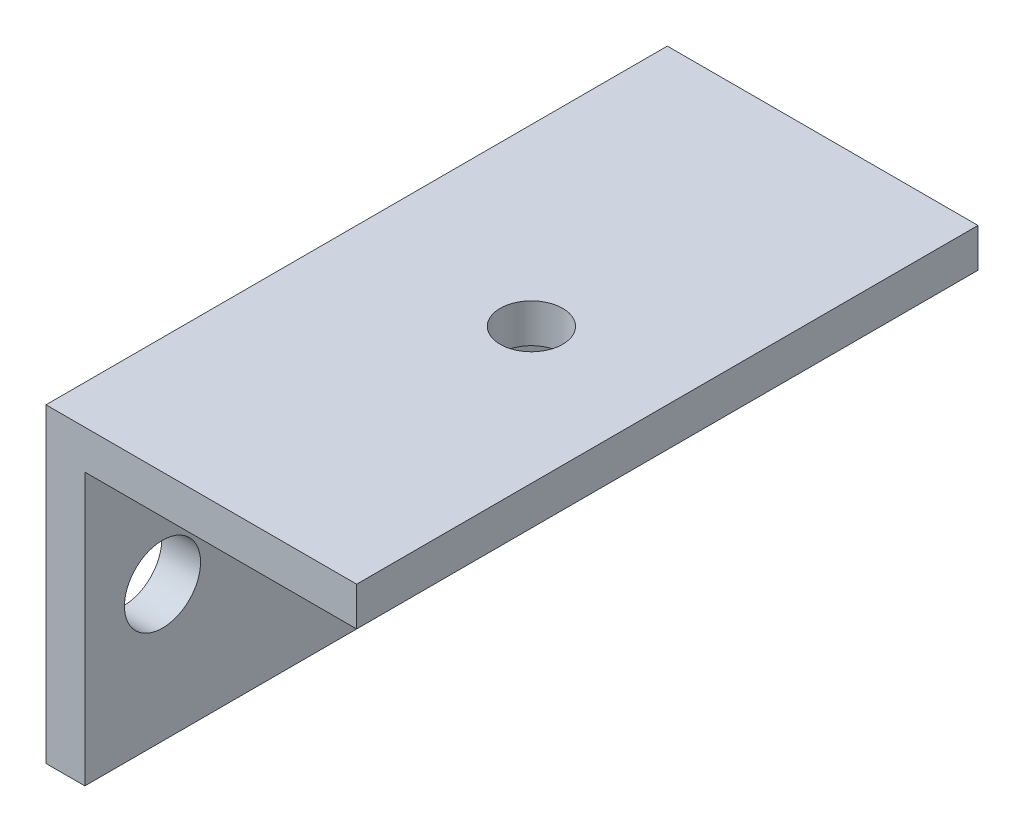
ISO-10303-21;
HEADER;
FILE_DESCRIPTION(('STEP AP214'),'2;1');
FILE_NAME('part.step','',(''),(''),'','','');
FILE_SCHEMA(('AUTOMOTIVE_DESIGN { 1 0 10303 214 1 1 1 1 }'));
ENDSEC;
DATA;
#1=APPLICATION_CONTEXT('core data for automotive mechanical design processes');
#2=APPLICATION_PROTOCOL_DEFINITION('international standard','automotive_design',2000,#1);
#3=PRODUCT_CONTEXT('',#1,'mechanical');
#4=PRODUCT('Part','Part','',(#3));
#5=PRODUCT_RELATED_PRODUCT_CATEGORY('part','',(#4));
#6=PRODUCT_DEFINITION_FORMATION('','',#4);
#7=PRODUCT_DEFINITION_CONTEXT('part definition',#1,'design');
#8=PRODUCT_DEFINITION('design','',#6,#7);
#9=PRODUCT_DEFINITION_SHAPE('','',#8);
#10=(LENGTH_UNIT() NAMED_UNIT(*) SI_UNIT(.MILLI.,.METRE.));
#11=(NAMED_UNIT(*) PLANE_ANGLE_UNIT() SI_UNIT($,.RADIAN.));
#12=(NAMED_UNIT(*) SI_UNIT($,.STERADIAN.) SOLID_ANGLE_UNIT());
#13=UNCERTAINTY_MEASURE_WITH_UNIT(LENGTH_MEASURE(1.E-05),#10,'distance_accuracy_value','');
#14=(GEOMETRIC_REPRESENTATION_CONTEXT(3) GLOBAL_UNCERTAINTY_ASSIGNED_CONTEXT((#13)) GLOBAL_UNIT_ASSIGNED_CONTEXT((#10,
#11,#12)) REPRESENTATION_CONTEXT('',''));
#15=CARTESIAN_POINT('',(0.,0.,0.));
#16=DIRECTION('',(0.,0.,1.));
#17=DIRECTION('',(1.,0.,0.));
#18=AXIS2_PLACEMENT_3D('',#15,#16,#17);
#19=CARTESIAN_POINT('',(3.175,0.,50.8));
#20=DIRECTION('',(0.,1.,0.));
#21=DIRECTION('',(-1.,0.,0.));
#22=AXIS2_PLACEMENT_3D('',#19,#20,#21);
#23=PLANE('',#22);
#24=DIRECTION('',(1.,0.,0.));
#25=VECTOR('',#24,1.);
#26=CARTESIAN_POINT('',(3.175,0.,0.));
#27=LINE('',#26,#25);
#28=CARTESIAN_POINT('',(0.,0.,0.));
#29=VERTEX_POINT('',#28);
#30=CARTESIAN_POINT('',(3.175,0.,0.));
#31=VERTEX_POINT('',#30);
#32=EDGE_CURVE('E130',#29,#31,#27,.T.);
#33=ORIENTED_EDGE('',*,*,#32,.T.);
#34=DIRECTION('',(0.,0.,-1.));
#35=VECTOR('',#34,1.);
#36=CARTESIAN_POINT('',(3.175,0.,50.8));
#37=LINE('',#36,#35);
#38=CARTESIAN_POINT('',(3.175,0.,50.8));
#39=VERTEX_POINT('',#38);
#40=EDGE_CURVE('E13',#39,#31,#37,.T.);
#41=ORIENTED_EDGE('',*,*,#40,.F.);
#42=DIRECTION('',(1.,0.,0.));
#43=VECTOR('',#42,1.);
#44=CARTESIAN_POINT('',(3.175,0.,50.8));
#45=LINE('',#44,#43);
#46=CARTESIAN_POINT('',(0.,0.,50.8));
#47=VERTEX_POINT('',#46);
#48=EDGE_CURVE('E141',#47,#39,#45,.T.);
#49=ORIENTED_EDGE('',*,*,#48,.F.);
#50=DIRECTION('',(0.,0.,-1.));
#51=VECTOR('',#50,1.);
#52=CARTESIAN_POINT('',(0.,0.,50.8));
#53=LINE('',#52,#51);
#54=EDGE_CURVE('E126',#47,#29,#53,.T.);
#55=ORIENTED_EDGE('',*,*,#54,.T.);
#56=EDGE_LOOP('',(#33,#41,#49,#55));
#57=FACE_BOUND('',#56,.T.);
#58=ADVANCED_FACE('F46',(#57),#23,.F.);
#59=CARTESIAN_POINT('',(3.175,22.225,50.8));
#60=DIRECTION('',(-1.,0.,0.));
#61=DIRECTION('',(0.,-1.,0.));
#62=AXIS2_PLACEMENT_3D('',#59,#60,#61);
#63=PLANE('',#62);
#64=CARTESIAN_POINT('',(3.175,11.1125,6.35));
#65=DIRECTION('',(1.,0.,0.));
#66=DIRECTION('',(0.,1.,0.));
#67=AXIS2_PLACEMENT_3D('',#64,#65,#66);
#68=CIRCLE('',#67,3.1115);
#69=CARTESIAN_POINT('',(3.175,14.224,6.35));
#70=VERTEX_POINT('',#69);
#71=EDGE_CURVE('E265',#70,#70,#68,.T.);
#72=ORIENTED_EDGE('',*,*,#71,.F.);
#73=EDGE_LOOP('',(#72));
#74=FACE_BOUND('',#73,.T.);
#75=CARTESIAN_POINT('',(3.175,11.1125,44.45));
#76=DIRECTION('',(1.,0.,0.));
#77=DIRECTION('',(0.,1.,0.));
#78=AXIS2_PLACEMENT_3D('',#75,#76,#77);
#79=CIRCLE('',#78,3.1115);
#80=CARTESIAN_POINT('',(3.175,14.224,44.45));
#81=VERTEX_POINT('',#80);
#82=EDGE_CURVE('E261',#81,#81,#79,.T.);
#83=ORIENTED_EDGE('',*,*,#82,.F.);
#84=EDGE_LOOP('',(#83));
#85=FACE_BOUND('',#84,.T.);
#86=DIRECTION('',(0.,1.,0.));
#87=VECTOR('',#86,1.);
#88=CARTESIAN_POINT('',(3.175,22.225,0.));
#89=LINE('',#88,#87);
#90=CARTESIAN_POINT('',(3.175,22.225,0.));
#91=VERTEX_POINT('',#90);
#92=EDGE_CURVE('E133',#31,#91,#89,.T.);
#93=ORIENTED_EDGE('',*,*,#92,.T.);
#94=DIRECTION('',(0.,0.,-1.));
#95=VECTOR('',#94,1.);
#96=CARTESIAN_POINT('',(3.175,22.225,50.8));
#97=LINE('',#96,#95);
#98=CARTESIAN_POINT('',(3.175,22.225,50.8));
#99=VERTEX_POINT('',#98);
#100=EDGE_CURVE('E54',#99,#91,#97,.T.);
#101=ORIENTED_EDGE('',*,*,#100,.F.);
#102=DIRECTION('',(0.,1.,0.));
#103=VECTOR('',#102,1.);
#104=CARTESIAN_POINT('',(3.175,22.225,50.8));
#105=LINE('',#104,#103);
#106=EDGE_CURVE('E99',#39,#99,#105,.T.);
#107=ORIENTED_EDGE('',*,*,#106,.F.);
#108=ORIENTED_EDGE('',*,*,#40,.T.);
#109=EDGE_LOOP('',(#93,#101,#107,#108));
#110=FACE_BOUND('',#109,.T.);
#111=ADVANCED_FACE('F169',(#74,#85,#110),#63,.F.);
#112=CARTESIAN_POINT('',(25.4,22.225,50.8));
#113=DIRECTION('',(0.,1.,0.));
#114=DIRECTION('',(-1.,0.,0.));
#115=AXIS2_PLACEMENT_3D('',#112,#113,#114);
#116=PLANE('',#115);
#117=CARTESIAN_POINT('',(14.2875,22.225,25.4));
#118=DIRECTION('',(0.,-1.,0.));
#119=DIRECTION('',(0.,0.,-1.));
#120=AXIS2_PLACEMENT_3D('',#117,#118,#119);
#121=CIRCLE('',#120,2.55269999999999);
#122=CARTESIAN_POINT('',(14.2875,22.225,22.8473));
#123=VERTEX_POINT('',#122);
#124=EDGE_CURVE('E275',#123,#123,#121,.T.);
#125=ORIENTED_EDGE('',*,*,#124,.F.);
#126=EDGE_LOOP('',(#125));
#127=FACE_BOUND('',#126,.T.);
#128=DIRECTION('',(1.,0.,0.));
#129=VECTOR('',#128,1.);
#130=CARTESIAN_POINT('',(25.4,22.225,0.));
#131=LINE('',#130,#129);
#132=CARTESIAN_POINT('',(25.4,22.225,0.));
#133=VERTEX_POINT('',#132);
#134=EDGE_CURVE('E136',#91,#133,#131,.T.);
#135=ORIENTED_EDGE('',*,*,#134,.T.);
#136=DIRECTION('',(0.,0.,-1.));
#137=VECTOR('',#136,1.);
#138=CARTESIAN_POINT('',(25.4,22.225,50.8));
#139=LINE('',#138,#137);
#140=CARTESIAN_POINT('',(25.4,22.225,50.8));
#141=VERTEX_POINT('',#140);
#142=EDGE_CURVE('E121',#141,#133,#139,.T.);
#143=ORIENTED_EDGE('',*,*,#142,.F.);
#144=DIRECTION('',(1.,0.,0.));
#145=VECTOR('',#144,1.);
#146=CARTESIAN_POINT('',(25.4,22.225,50.8));
#147=LINE('',#146,#145);
#148=EDGE_CURVE('E112',#99,#141,#147,.T.);
#149=ORIENTED_EDGE('',*,*,#148,.F.);
#150=ORIENTED_EDGE('',*,*,#100,.T.);
#151=EDGE_LOOP('',(#135,#143,#149,#150));
#152=FACE_BOUND('',#151,.T.);
#153=ADVANCED_FACE('F147',(#127,#152),#116,.F.);
#154=CARTESIAN_POINT('',(25.4,25.4,50.8));
#155=DIRECTION('',(-1.,0.,0.));
#156=DIRECTION('',(0.,0.,1.));
#157=AXIS2_PLACEMENT_3D('',#154,#155,#156);
#158=PLANE('',#157);
#159=DIRECTION('',(0.,1.,0.));
#160=VECTOR('',#159,1.);
#161=CARTESIAN_POINT('',(25.4,25.4,0.));
#162=LINE('',#161,#160);
#163=CARTESIAN_POINT('',(25.4,25.4,0.));
#164=VERTEX_POINT('',#163);
#165=EDGE_CURVE('E120',#133,#164,#162,.T.);
#166=ORIENTED_EDGE('',*,*,#165,.T.);
#167=DIRECTION('',(0.,0.,-1.));
#168=VECTOR('',#167,1.);
#169=CARTESIAN_POINT('',(25.4,25.4,50.8));
#170=LINE('',#169,#168);
#171=CARTESIAN_POINT('',(25.4,25.4,50.8));
#172=VERTEX_POINT('',#171);
#173=EDGE_CURVE('E117',#172,#164,#170,.T.);
#174=ORIENTED_EDGE('',*,*,#173,.F.);
#175=DIRECTION('',(0.,1.,0.));
#176=VECTOR('',#175,1.);
#177=CARTESIAN_POINT('',(25.4,25.4,50.8));
#178=LINE('',#177,#176);
#179=EDGE_CURVE('E106',#141,#172,#178,.T.);
#180=ORIENTED_EDGE('',*,*,#179,.F.);
#181=ORIENTED_EDGE('',*,*,#142,.T.);
#182=EDGE_LOOP('',(#166,#174,#180,#181));
#183=FACE_BOUND('',#182,.T.);
#184=ADVANCED_FACE('F118',(#183),#158,.F.);
#185=CARTESIAN_POINT('',(0.,25.4,50.8));
#186=DIRECTION('',(0.,-1.,0.));
#187=DIRECTION('',(0.,0.,-1.));
#188=AXIS2_PLACEMENT_3D('',#185,#186,#187);
#189=PLANE('',#188);
#190=CARTESIAN_POINT('',(14.2875,25.4,25.4));
#191=DIRECTION('',(0.,-1.,0.));
#192=DIRECTION('',(0.,0.,-1.));
#193=AXIS2_PLACEMENT_3D('',#190,#191,#192);
#194=CIRCLE('',#193,2.5527);
#195=CARTESIAN_POINT('',(14.2875,25.4,22.8473));
#196=VERTEX_POINT('',#195);
#197=EDGE_CURVE('E271',#196,#196,#194,.T.);
#198=ORIENTED_EDGE('',*,*,#197,.T.);
#199=EDGE_LOOP('',(#198));
#200=FACE_BOUND('',#199,.T.);
#201=DIRECTION('',(-1.,0.,0.));
#202=VECTOR('',#201,1.);
#203=CARTESIAN_POINT('',(0.,25.4,0.));
#204=LINE('',#203,#202);
#205=CARTESIAN_POINT('',(0.,25.4,0.));
#206=VERTEX_POINT('',#205);
#207=EDGE_CURVE('E85',#164,#206,#204,.T.);
#208=ORIENTED_EDGE('',*,*,#207,.T.);
#209=DIRECTION('',(0.,0.,-1.));
#210=VECTOR('',#209,1.);
#211=CARTESIAN_POINT('',(0.,25.4,50.8));
#212=LINE('',#211,#210);
#213=CARTESIAN_POINT('',(0.,25.4,50.8));
#214=VERTEX_POINT('',#213);
#215=EDGE_CURVE('E122',#214,#206,#212,.T.);
#216=ORIENTED_EDGE('',*,*,#215,.F.);
#217=DIRECTION('',(-1.,0.,0.));
#218=VECTOR('',#217,1.);
#219=CARTESIAN_POINT('',(0.,25.4,50.8));
#220=LINE('',#219,#218);
#221=EDGE_CURVE('E110',#172,#214,#220,.T.);
#222=ORIENTED_EDGE('',*,*,#221,.F.);
#223=ORIENTED_EDGE('',*,*,#173,.T.);
#224=EDGE_LOOP('',(#208,#216,#222,#223));
#225=FACE_BOUND('',#224,.T.);
#226=ADVANCED_FACE('F124',(#200,#225),#189,.F.);
#227=CARTESIAN_POINT('',(0.,0.,50.8));
#228=DIRECTION('',(1.,0.,0.));
#229=DIRECTION('',(0.,0.,-1.));
#230=AXIS2_PLACEMENT_3D('',#227,#228,#229);
#231=PLANE('',#230);
#232=CARTESIAN_POINT('',(0.,11.1125,6.35));
#233=DIRECTION('',(1.,0.,0.));
#234=DIRECTION('',(0.,1.,0.));
#235=AXIS2_PLACEMENT_3D('',#232,#233,#234);
#236=CIRCLE('',#235,3.1115);
#237=CARTESIAN_POINT('',(0.,14.224,6.35));
#238=VERTEX_POINT('',#237);
#239=EDGE_CURVE('E262',#238,#238,#236,.T.);
#240=ORIENTED_EDGE('',*,*,#239,.T.);
#241=EDGE_LOOP('',(#240));
#242=FACE_BOUND('',#241,.T.);
#243=CARTESIAN_POINT('',(0.,11.1125,44.45));
#244=DIRECTION('',(1.,0.,0.));
#245=DIRECTION('',(0.,1.,0.));
#246=AXIS2_PLACEMENT_3D('',#243,#244,#245);
#247=CIRCLE('',#246,3.1115);
#248=CARTESIAN_POINT('',(0.,14.224,44.45));
#249=VERTEX_POINT('',#248);
#250=EDGE_CURVE('E134',#249,#249,#247,.T.);
#251=ORIENTED_EDGE('',*,*,#250,.T.);
#252=EDGE_LOOP('',(#251));
#253=FACE_BOUND('',#252,.T.);
#254=DIRECTION('',(0.,-1.,0.));
#255=VECTOR('',#254,1.);
#256=CARTESIAN_POINT('',(0.,0.,0.));
#257=LINE('',#256,#255);
#258=EDGE_CURVE('E91',#206,#29,#257,.T.);
#259=ORIENTED_EDGE('',*,*,#258,.T.);
#260=ORIENTED_EDGE('',*,*,#54,.F.);
#261=DIRECTION('',(0.,-1.,0.));
#262=VECTOR('',#261,1.);
#263=CARTESIAN_POINT('',(0.,0.,50.8));
#264=LINE('',#263,#262);
#265=EDGE_CURVE('E62',#214,#47,#264,.T.);
#266=ORIENTED_EDGE('',*,*,#265,.F.);
#267=ORIENTED_EDGE('',*,*,#215,.T.);
#268=EDGE_LOOP('',(#259,#260,#266,#267));
#269=FACE_BOUND('',#268,.T.);
#270=ADVANCED_FACE('F154',(#242,#253,#269),#231,.F.);
#271=CARTESIAN_POINT('',(0.,0.,50.8));
#272=DIRECTION('',(0.,0.,-1.));
#273=DIRECTION('',(-1.,0.,0.));
#274=AXIS2_PLACEMENT_3D('',#271,#272,#273);
#275=PLANE('',#274);
#276=ORIENTED_EDGE('',*,*,#48,.T.);
#277=ORIENTED_EDGE('',*,*,#106,.T.);
#278=ORIENTED_EDGE('',*,*,#148,.T.);
#279=ORIENTED_EDGE('',*,*,#179,.T.);
#280=ORIENTED_EDGE('',*,*,#221,.T.);
#281=ORIENTED_EDGE('',*,*,#265,.T.);
#282=EDGE_LOOP('',(#276,#277,#278,#279,#280,#281));
#283=FACE_BOUND('',#282,.T.);
#284=ADVANCED_FACE('F108',(#283),#275,.F.);
#285=CARTESIAN_POINT('',(0.,0.,0.));
#286=DIRECTION('',(0.,0.,-1.));
#287=DIRECTION('',(-1.,0.,0.));
#288=AXIS2_PLACEMENT_3D('',#285,#286,#287);
#289=PLANE('',#288);
#290=ORIENTED_EDGE('',*,*,#32,.F.);
#291=ORIENTED_EDGE('',*,*,#258,.F.);
#292=ORIENTED_EDGE('',*,*,#207,.F.);
#293=ORIENTED_EDGE('',*,*,#165,.F.);
#294=ORIENTED_EDGE('',*,*,#134,.F.);
#295=ORIENTED_EDGE('',*,*,#92,.F.);
#296=EDGE_LOOP('',(#290,#291,#292,#293,#294,#295));
#297=FACE_BOUND('',#296,.T.);
#298=ADVANCED_FACE('F150',(#297),#289,.T.);
#299=CARTESIAN_POINT('',(0.,11.1125,44.45));
#300=DIRECTION('',(1.,0.,0.));
#301=DIRECTION('',(0.,1.,0.));
#302=AXIS2_PLACEMENT_3D('',#299,#300,#301);
#303=CYLINDRICAL_SURFACE('',#302,3.1115);
#304=ORIENTED_EDGE('',*,*,#250,.F.);
#305=EDGE_LOOP('',(#304));
#306=FACE_BOUND('',#305,.T.);
#307=ORIENTED_EDGE('',*,*,#82,.T.);
#308=EDGE_LOOP('',(#307));
#309=FACE_BOUND('',#308,.T.);
#310=ADVANCED_FACE('F215',(#306,#309),#303,.F.);
#311=CARTESIAN_POINT('',(0.,11.1125,6.35));
#312=DIRECTION('',(1.,0.,0.));
#313=DIRECTION('',(0.,1.,0.));
#314=AXIS2_PLACEMENT_3D('',#311,#312,#313);
#315=CYLINDRICAL_SURFACE('',#314,3.1115);
#316=ORIENTED_EDGE('',*,*,#239,.F.);
#317=EDGE_LOOP('',(#316));
#318=FACE_BOUND('',#317,.T.);
#319=ORIENTED_EDGE('',*,*,#71,.T.);
#320=EDGE_LOOP('',(#319));
#321=FACE_BOUND('',#320,.T.);
#322=ADVANCED_FACE('F205',(#318,#321),#315,.F.);
#323=CARTESIAN_POINT('',(14.2875,22.225,25.4));
#324=DIRECTION('',(0.,-1.,0.));
#325=DIRECTION('',(0.,0.,-1.));
#326=AXIS2_PLACEMENT_3D('',#323,#324,#325);
#327=CYLINDRICAL_SURFACE('',#326,2.55269999999999);
#328=ORIENTED_EDGE('',*,*,#197,.F.);
#329=EDGE_LOOP('',(#328));
#330=FACE_BOUND('',#329,.T.);
#331=ORIENTED_EDGE('',*,*,#124,.T.);
#332=EDGE_LOOP('',(#331));
#333=FACE_BOUND('',#332,.T.);
#334=ADVANCED_FACE('F201',(#330,#333),#327,.F.);
#335=CLOSED_SHELL('',(#58,#111,#153,#184,#226,#270,#284,#298,#310,#322,#334));
#336=MANIFOLD_SOLID_BREP('B2',#335);
#337=ADVANCED_BREP_SHAPE_REPRESENTATION('',(#18,#336),#14);
#338=SHAPE_DEFINITION_REPRESENTATION(#9,#337);
ENDSEC;
END-ISO-10303-21;
